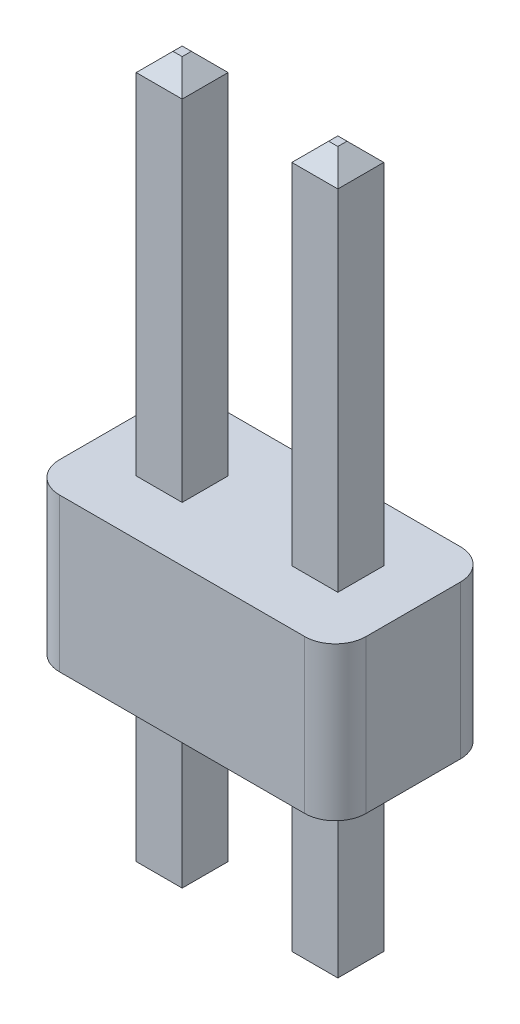
ISO-10303-21;
HEADER;
FILE_DESCRIPTION(('STEP AP214'),'2;1');
FILE_NAME('part.step','',(''),(''),'','','');
FILE_SCHEMA(('AUTOMOTIVE_DESIGN { 1 0 10303 214 1 1 1 1 }'));
ENDSEC;
DATA;
#1=APPLICATION_CONTEXT('core data for automotive mechanical design processes');
#2=APPLICATION_PROTOCOL_DEFINITION('international standard','automotive_design',2000,#1);
#3=PRODUCT_CONTEXT('',#1,'mechanical');
#4=PRODUCT('Part','Part','',(#3));
#5=PRODUCT_RELATED_PRODUCT_CATEGORY('part','',(#4));
#6=PRODUCT_DEFINITION_FORMATION('','',#4);
#7=PRODUCT_DEFINITION_CONTEXT('part definition',#1,'design');
#8=PRODUCT_DEFINITION('design','',#6,#7);
#9=PRODUCT_DEFINITION_SHAPE('','',#8);
#10=(LENGTH_UNIT() NAMED_UNIT(*) SI_UNIT(.MILLI.,.METRE.));
#11=(NAMED_UNIT(*) PLANE_ANGLE_UNIT() SI_UNIT($,.RADIAN.));
#12=(NAMED_UNIT(*) SI_UNIT($,.STERADIAN.) SOLID_ANGLE_UNIT());
#13=UNCERTAINTY_MEASURE_WITH_UNIT(LENGTH_MEASURE(1.E-05),#10,'distance_accuracy_value','');
#14=(GEOMETRIC_REPRESENTATION_CONTEXT(3) GLOBAL_UNCERTAINTY_ASSIGNED_CONTEXT((#13)) GLOBAL_UNIT_ASSIGNED_CONTEXT((#10,
#11,#12)) REPRESENTATION_CONTEXT('',''));
#15=CARTESIAN_POINT('',(0.,0.,0.));
#16=DIRECTION('',(0.,0.,1.));
#17=DIRECTION('',(1.,0.,0.));
#18=AXIS2_PLACEMENT_3D('',#15,#16,#17);
#19=CARTESIAN_POINT('',(2.,2.5,0.77));
#20=DIRECTION('',(0.,-1.,0.));
#21=DIRECTION('',(0.,0.,-1.));
#22=AXIS2_PLACEMENT_3D('',#19,#20,#21);
#23=CYLINDRICAL_SURFACE('',#22,0.5);
#24=CARTESIAN_POINT('',(2.,0.,0.77));
#25=DIRECTION('',(0.,1.,0.));
#26=DIRECTION('',(0.,0.,1.));
#27=AXIS2_PLACEMENT_3D('',#24,#25,#26);
#28=CIRCLE('',#27,0.5);
#29=CARTESIAN_POINT('',(2.,0.,1.27));
#30=VERTEX_POINT('',#29);
#31=CARTESIAN_POINT('',(2.5,0.,0.77));
#32=VERTEX_POINT('',#31);
#33=EDGE_CURVE('E283',#30,#32,#28,.T.);
#34=ORIENTED_EDGE('',*,*,#33,.T.);
#35=DIRECTION('',(0.,-1.,0.));
#36=VECTOR('',#35,1.);
#37=CARTESIAN_POINT('',(2.5,2.5,0.77));
#38=LINE('',#37,#36);
#39=CARTESIAN_POINT('',(2.5,2.5,0.77));
#40=VERTEX_POINT('',#39);
#41=EDGE_CURVE('E338',#40,#32,#38,.T.);
#42=ORIENTED_EDGE('',*,*,#41,.F.);
#43=CARTESIAN_POINT('',(2.,2.5,0.77));
#44=DIRECTION('',(0.,1.,0.));
#45=DIRECTION('',(0.,0.,1.));
#46=AXIS2_PLACEMENT_3D('',#43,#44,#45);
#47=CIRCLE('',#46,0.5);
#48=CARTESIAN_POINT('',(2.,2.5,1.27));
#49=VERTEX_POINT('',#48);
#50=EDGE_CURVE('E284',#49,#40,#47,.T.);
#51=ORIENTED_EDGE('',*,*,#50,.F.);
#52=DIRECTION('',(0.,-1.,0.));
#53=VECTOR('',#52,1.);
#54=CARTESIAN_POINT('',(2.,2.5,1.27));
#55=LINE('',#54,#53);
#56=EDGE_CURVE('E302',#49,#30,#55,.T.);
#57=ORIENTED_EDGE('',*,*,#56,.T.);
#58=EDGE_LOOP('',(#34,#42,#51,#57));
#59=FACE_BOUND('',#58,.T.);
#60=ADVANCED_FACE('F17',(#59),#23,.T.);
#61=CARTESIAN_POINT('',(2.5,2.5,-0.77));
#62=DIRECTION('',(-1.,0.,0.));
#63=DIRECTION('',(0.,0.,1.));
#64=AXIS2_PLACEMENT_3D('',#61,#62,#63);
#65=PLANE('',#64);
#66=DIRECTION('',(0.,0.,-1.));
#67=VECTOR('',#66,1.);
#68=CARTESIAN_POINT('',(2.5,0.,-0.77));
#69=LINE('',#68,#67);
#70=CARTESIAN_POINT('',(2.5,0.,-0.77));
#71=VERTEX_POINT('',#70);
#72=EDGE_CURVE('E305',#32,#71,#69,.T.);
#73=ORIENTED_EDGE('',*,*,#72,.T.);
#74=DIRECTION('',(0.,-1.,0.));
#75=VECTOR('',#74,1.);
#76=CARTESIAN_POINT('',(2.5,2.5,-0.77));
#77=LINE('',#76,#75);
#78=CARTESIAN_POINT('',(2.5,2.5,-0.77));
#79=VERTEX_POINT('',#78);
#80=EDGE_CURVE('E335',#79,#71,#77,.T.);
#81=ORIENTED_EDGE('',*,*,#80,.F.);
#82=DIRECTION('',(0.,0.,-1.));
#83=VECTOR('',#82,1.);
#84=CARTESIAN_POINT('',(2.5,2.5,-0.77));
#85=LINE('',#84,#83);
#86=EDGE_CURVE('E287',#40,#79,#85,.T.);
#87=ORIENTED_EDGE('',*,*,#86,.F.);
#88=ORIENTED_EDGE('',*,*,#41,.T.);
#89=EDGE_LOOP('',(#73,#81,#87,#88));
#90=FACE_BOUND('',#89,.T.);
#91=ADVANCED_FACE('F505',(#90),#65,.F.);
#92=CARTESIAN_POINT('',(2.,2.5,-0.77));
#93=DIRECTION('',(0.,-1.,0.));
#94=DIRECTION('',(0.,0.,-1.));
#95=AXIS2_PLACEMENT_3D('',#92,#93,#94);
#96=CYLINDRICAL_SURFACE('',#95,0.5);
#97=CARTESIAN_POINT('',(2.,0.,-0.77));
#98=DIRECTION('',(0.,1.,0.));
#99=DIRECTION('',(0.,0.,1.));
#100=AXIS2_PLACEMENT_3D('',#97,#98,#99);
#101=CIRCLE('',#100,0.5);
#102=CARTESIAN_POINT('',(2.,0.,-1.27));
#103=VERTEX_POINT('',#102);
#104=EDGE_CURVE('E307',#71,#103,#101,.T.);
#105=ORIENTED_EDGE('',*,*,#104,.T.);
#106=DIRECTION('',(0.,-1.,0.));
#107=VECTOR('',#106,1.);
#108=CARTESIAN_POINT('',(2.,2.5,-1.27));
#109=LINE('',#108,#107);
#110=CARTESIAN_POINT('',(2.,2.5,-1.27));
#111=VERTEX_POINT('',#110);
#112=EDGE_CURVE('E332',#111,#103,#109,.T.);
#113=ORIENTED_EDGE('',*,*,#112,.F.);
#114=CARTESIAN_POINT('',(2.,2.5,-0.77));
#115=DIRECTION('',(0.,1.,0.));
#116=DIRECTION('',(0.,0.,1.));
#117=AXIS2_PLACEMENT_3D('',#114,#115,#116);
#118=CIRCLE('',#117,0.5);
#119=EDGE_CURVE('E290',#79,#111,#118,.T.);
#120=ORIENTED_EDGE('',*,*,#119,.F.);
#121=ORIENTED_EDGE('',*,*,#80,.T.);
#122=EDGE_LOOP('',(#105,#113,#120,#121));
#123=FACE_BOUND('',#122,.T.);
#124=ADVANCED_FACE('F511',(#123),#96,.T.);
#125=CARTESIAN_POINT('',(-2.,2.5,-1.27));
#126=DIRECTION('',(0.,0.,1.));
#127=DIRECTION('',(1.,0.,0.));
#128=AXIS2_PLACEMENT_3D('',#125,#126,#127);
#129=PLANE('',#128);
#130=DIRECTION('',(-1.,0.,0.));
#131=VECTOR('',#130,1.);
#132=CARTESIAN_POINT('',(-2.,0.,-1.27));
#133=LINE('',#132,#131);
#134=CARTESIAN_POINT('',(-2.,0.,-1.27));
#135=VERTEX_POINT('',#134);
#136=EDGE_CURVE('E309',#103,#135,#133,.T.);
#137=ORIENTED_EDGE('',*,*,#136,.T.);
#138=DIRECTION('',(0.,-1.,0.));
#139=VECTOR('',#138,1.);
#140=CARTESIAN_POINT('',(-2.,2.5,-1.27));
#141=LINE('',#140,#139);
#142=CARTESIAN_POINT('',(-2.,2.5,-1.27));
#143=VERTEX_POINT('',#142);
#144=EDGE_CURVE('E329',#143,#135,#141,.T.);
#145=ORIENTED_EDGE('',*,*,#144,.F.);
#146=DIRECTION('',(-1.,0.,0.));
#147=VECTOR('',#146,1.);
#148=CARTESIAN_POINT('',(-2.,2.5,-1.27));
#149=LINE('',#148,#147);
#150=EDGE_CURVE('E292',#111,#143,#149,.T.);
#151=ORIENTED_EDGE('',*,*,#150,.F.);
#152=ORIENTED_EDGE('',*,*,#112,.T.);
#153=EDGE_LOOP('',(#137,#145,#151,#152));
#154=FACE_BOUND('',#153,.T.);
#155=ADVANCED_FACE('F875',(#154),#129,.F.);
#156=CARTESIAN_POINT('',(-2.,2.5,-0.77));
#157=DIRECTION('',(0.,-1.,0.));
#158=DIRECTION('',(0.,0.,-1.));
#159=AXIS2_PLACEMENT_3D('',#156,#157,#158);
#160=CYLINDRICAL_SURFACE('',#159,0.5);
#161=CARTESIAN_POINT('',(-2.,0.,-0.77));
#162=DIRECTION('',(0.,1.,0.));
#163=DIRECTION('',(0.,0.,1.));
#164=AXIS2_PLACEMENT_3D('',#161,#162,#163);
#165=CIRCLE('',#164,0.5);
#166=CARTESIAN_POINT('',(-2.5,0.,-0.77));
#167=VERTEX_POINT('',#166);
#168=EDGE_CURVE('E311',#135,#167,#165,.T.);
#169=ORIENTED_EDGE('',*,*,#168,.T.);
#170=DIRECTION('',(0.,-1.,0.));
#171=VECTOR('',#170,1.);
#172=CARTESIAN_POINT('',(-2.5,2.5,-0.77));
#173=LINE('',#172,#171);
#174=CARTESIAN_POINT('',(-2.5,2.5,-0.77));
#175=VERTEX_POINT('',#174);
#176=EDGE_CURVE('E326',#175,#167,#173,.T.);
#177=ORIENTED_EDGE('',*,*,#176,.F.);
#178=CARTESIAN_POINT('',(-2.,2.5,-0.77));
#179=DIRECTION('',(0.,1.,0.));
#180=DIRECTION('',(0.,0.,1.));
#181=AXIS2_PLACEMENT_3D('',#178,#179,#180);
#182=CIRCLE('',#181,0.5);
#183=EDGE_CURVE('E294',#143,#175,#182,.T.);
#184=ORIENTED_EDGE('',*,*,#183,.F.);
#185=ORIENTED_EDGE('',*,*,#144,.T.);
#186=EDGE_LOOP('',(#169,#177,#184,#185));
#187=FACE_BOUND('',#186,.T.);
#188=ADVANCED_FACE('F864',(#187),#160,.T.);
#189=CARTESIAN_POINT('',(-2.5,2.5,0.77));
#190=DIRECTION('',(1.,0.,0.));
#191=DIRECTION('',(0.,0.,-1.));
#192=AXIS2_PLACEMENT_3D('',#189,#190,#191);
#193=PLANE('',#192);
#194=DIRECTION('',(0.,0.,1.));
#195=VECTOR('',#194,1.);
#196=CARTESIAN_POINT('',(-2.5,0.,0.77));
#197=LINE('',#196,#195);
#198=CARTESIAN_POINT('',(-2.5,0.,0.77));
#199=VERTEX_POINT('',#198);
#200=EDGE_CURVE('E313',#167,#199,#197,.T.);
#201=ORIENTED_EDGE('',*,*,#200,.T.);
#202=DIRECTION('',(0.,-1.,0.));
#203=VECTOR('',#202,1.);
#204=CARTESIAN_POINT('',(-2.5,2.5,0.77));
#205=LINE('',#204,#203);
#206=CARTESIAN_POINT('',(-2.5,2.5,0.77));
#207=VERTEX_POINT('',#206);
#208=EDGE_CURVE('E323',#207,#199,#205,.T.);
#209=ORIENTED_EDGE('',*,*,#208,.F.);
#210=DIRECTION('',(0.,0.,1.));
#211=VECTOR('',#210,1.);
#212=CARTESIAN_POINT('',(-2.5,2.5,0.77));
#213=LINE('',#212,#211);
#214=EDGE_CURVE('E296',#175,#207,#213,.T.);
#215=ORIENTED_EDGE('',*,*,#214,.F.);
#216=ORIENTED_EDGE('',*,*,#176,.T.);
#217=EDGE_LOOP('',(#201,#209,#215,#216));
#218=FACE_BOUND('',#217,.T.);
#219=ADVANCED_FACE('F853',(#218),#193,.F.);
#220=CARTESIAN_POINT('',(-2.,2.5,0.77));
#221=DIRECTION('',(0.,-1.,0.));
#222=DIRECTION('',(0.,0.,-1.));
#223=AXIS2_PLACEMENT_3D('',#220,#221,#222);
#224=CYLINDRICAL_SURFACE('',#223,0.5);
#225=CARTESIAN_POINT('',(-2.,0.,0.77));
#226=DIRECTION('',(0.,1.,0.));
#227=DIRECTION('',(0.,0.,1.));
#228=AXIS2_PLACEMENT_3D('',#225,#226,#227);
#229=CIRCLE('',#228,0.5);
#230=CARTESIAN_POINT('',(-2.,0.,1.27));
#231=VERTEX_POINT('',#230);
#232=EDGE_CURVE('E315',#199,#231,#229,.T.);
#233=ORIENTED_EDGE('',*,*,#232,.T.);
#234=DIRECTION('',(0.,-1.,0.));
#235=VECTOR('',#234,1.);
#236=CARTESIAN_POINT('',(-2.,2.5,1.27));
#237=LINE('',#236,#235);
#238=CARTESIAN_POINT('',(-2.,2.5,1.27));
#239=VERTEX_POINT('',#238);
#240=EDGE_CURVE('E320',#239,#231,#237,.T.);
#241=ORIENTED_EDGE('',*,*,#240,.F.);
#242=CARTESIAN_POINT('',(-2.,2.5,0.77));
#243=DIRECTION('',(0.,1.,0.));
#244=DIRECTION('',(0.,0.,1.));
#245=AXIS2_PLACEMENT_3D('',#242,#243,#244);
#246=CIRCLE('',#245,0.5);
#247=EDGE_CURVE('E298',#207,#239,#246,.T.);
#248=ORIENTED_EDGE('',*,*,#247,.F.);
#249=ORIENTED_EDGE('',*,*,#208,.T.);
#250=EDGE_LOOP('',(#233,#241,#248,#249));
#251=FACE_BOUND('',#250,.T.);
#252=ADVANCED_FACE('F842',(#251),#224,.T.);
#253=CARTESIAN_POINT('',(2.,2.5,1.27));
#254=DIRECTION('',(0.,0.,-1.));
#255=DIRECTION('',(-1.,0.,0.));
#256=AXIS2_PLACEMENT_3D('',#253,#254,#255);
#257=PLANE('',#256);
#258=DIRECTION('',(1.,0.,0.));
#259=VECTOR('',#258,1.);
#260=CARTESIAN_POINT('',(2.,0.,1.27));
#261=LINE('',#260,#259);
#262=EDGE_CURVE('E288',#231,#30,#261,.T.);
#263=ORIENTED_EDGE('',*,*,#262,.T.);
#264=ORIENTED_EDGE('',*,*,#56,.F.);
#265=DIRECTION('',(1.,0.,0.));
#266=VECTOR('',#265,1.);
#267=CARTESIAN_POINT('',(2.,2.5,1.27));
#268=LINE('',#267,#266);
#269=EDGE_CURVE('E300',#239,#49,#268,.T.);
#270=ORIENTED_EDGE('',*,*,#269,.F.);
#271=ORIENTED_EDGE('',*,*,#240,.T.);
#272=EDGE_LOOP('',(#263,#264,#270,#271));
#273=FACE_BOUND('',#272,.T.);
#274=ADVANCED_FACE('F832',(#273),#257,.F.);
#275=CARTESIAN_POINT('',(2.,2.5,0.77));
#276=DIRECTION('',(0.,1.,0.));
#277=DIRECTION('',(0.,0.,1.));
#278=AXIS2_PLACEMENT_3D('',#275,#276,#277);
#279=PLANE('',#278);
#280=DIRECTION('',(0.,0.,1.));
#281=VECTOR('',#280,1.);
#282=CARTESIAN_POINT('',(0.895,2.5,0.77));
#283=LINE('',#282,#281);
#284=CARTESIAN_POINT('',(0.895,2.5,-0.375));
#285=VERTEX_POINT('',#284);
#286=CARTESIAN_POINT('',(0.895,2.5,0.375));
#287=VERTEX_POINT('',#286);
#288=EDGE_CURVE('E257',#285,#287,#283,.T.);
#289=ORIENTED_EDGE('',*,*,#288,.F.);
#290=DIRECTION('',(-1.,0.,0.));
#291=VECTOR('',#290,1.);
#292=CARTESIAN_POINT('',(2.,2.5,-0.375));
#293=LINE('',#292,#291);
#294=CARTESIAN_POINT('',(1.645,2.5,-0.375));
#295=VERTEX_POINT('',#294);
#296=EDGE_CURVE('E235',#295,#285,#293,.T.);
#297=ORIENTED_EDGE('',*,*,#296,.F.);
#298=DIRECTION('',(0.,0.,-1.));
#299=VECTOR('',#298,1.);
#300=CARTESIAN_POINT('',(1.645,2.5,0.77));
#301=LINE('',#300,#299);
#302=CARTESIAN_POINT('',(1.645,2.5,0.375));
#303=VERTEX_POINT('',#302);
#304=EDGE_CURVE('E228',#303,#295,#301,.T.);
#305=ORIENTED_EDGE('',*,*,#304,.F.);
#306=DIRECTION('',(1.,0.,0.));
#307=VECTOR('',#306,1.);
#308=CARTESIAN_POINT('',(2.,2.5,0.375));
#309=LINE('',#308,#307);
#310=EDGE_CURVE('E232',#287,#303,#309,.T.);
#311=ORIENTED_EDGE('',*,*,#310,.F.);
#312=EDGE_LOOP('',(#289,#297,#305,#311));
#313=FACE_BOUND('',#312,.T.);
#314=DIRECTION('',(0.,0.,-1.));
#315=VECTOR('',#314,1.);
#316=CARTESIAN_POINT('',(-0.895,2.5,0.77));
#317=LINE('',#316,#315);
#318=CARTESIAN_POINT('',(-0.895,2.5,0.375));
#319=VERTEX_POINT('',#318);
#320=CARTESIAN_POINT('',(-0.895,2.5,-0.375));
#321=VERTEX_POINT('',#320);
#322=EDGE_CURVE('E280',#319,#321,#317,.T.);
#323=ORIENTED_EDGE('',*,*,#322,.F.);
#324=DIRECTION('',(1.,0.,0.));
#325=VECTOR('',#324,1.);
#326=CARTESIAN_POINT('',(2.,2.5,0.375));
#327=LINE('',#326,#325);
#328=CARTESIAN_POINT('',(-1.645,2.5,0.375));
#329=VERTEX_POINT('',#328);
#330=EDGE_CURVE('E277',#329,#319,#327,.T.);
#331=ORIENTED_EDGE('',*,*,#330,.F.);
#332=DIRECTION('',(0.,0.,1.));
#333=VECTOR('',#332,1.);
#334=CARTESIAN_POINT('',(-1.645,2.5,0.77));
#335=LINE('',#334,#333);
#336=CARTESIAN_POINT('',(-1.645,2.5,-0.375));
#337=VERTEX_POINT('',#336);
#338=EDGE_CURVE('E274',#337,#329,#335,.T.);
#339=ORIENTED_EDGE('',*,*,#338,.F.);
#340=DIRECTION('',(-1.,0.,0.));
#341=VECTOR('',#340,1.);
#342=CARTESIAN_POINT('',(2.,2.5,-0.375));
#343=LINE('',#342,#341);
#344=EDGE_CURVE('E262',#321,#337,#343,.T.);
#345=ORIENTED_EDGE('',*,*,#344,.F.);
#346=EDGE_LOOP('',(#323,#331,#339,#345));
#347=FACE_BOUND('',#346,.T.);
#348=ORIENTED_EDGE('',*,*,#50,.T.);
#349=ORIENTED_EDGE('',*,*,#86,.T.);
#350=ORIENTED_EDGE('',*,*,#119,.T.);
#351=ORIENTED_EDGE('',*,*,#150,.T.);
#352=ORIENTED_EDGE('',*,*,#183,.T.);
#353=ORIENTED_EDGE('',*,*,#214,.T.);
#354=ORIENTED_EDGE('',*,*,#247,.T.);
#355=ORIENTED_EDGE('',*,*,#269,.T.);
#356=EDGE_LOOP('',(#348,#349,#350,#351,#352,#353,#354,#355));
#357=FACE_BOUND('',#356,.T.);
#358=ADVANCED_FACE('F230',(#313,#347,#357),#279,.T.);
#359=CARTESIAN_POINT('',(2.,0.,0.77));
#360=DIRECTION('',(0.,1.,0.));
#361=DIRECTION('',(0.,0.,1.));
#362=AXIS2_PLACEMENT_3D('',#359,#360,#361);
#363=PLANE('',#362);
#364=DIRECTION('',(-1.,0.,0.));
#365=VECTOR('',#364,1.);
#366=CARTESIAN_POINT('',(2.,0.,-0.375));
#367=LINE('',#366,#365);
#368=CARTESIAN_POINT('',(1.645,0.,-0.375));
#369=VERTEX_POINT('',#368);
#370=CARTESIAN_POINT('',(0.895,0.,-0.375));
#371=VERTEX_POINT('',#370);
#372=EDGE_CURVE('E359',#369,#371,#367,.T.);
#373=ORIENTED_EDGE('',*,*,#372,.T.);
#374=DIRECTION('',(0.,0.,1.));
#375=VECTOR('',#374,1.);
#376=CARTESIAN_POINT('',(0.895,0.,0.77));
#377=LINE('',#376,#375);
#378=CARTESIAN_POINT('',(0.895,0.,0.375));
#379=VERTEX_POINT('',#378);
#380=EDGE_CURVE('E362',#371,#379,#377,.T.);
#381=ORIENTED_EDGE('',*,*,#380,.T.);
#382=DIRECTION('',(1.,0.,0.));
#383=VECTOR('',#382,1.);
#384=CARTESIAN_POINT('',(2.,0.,0.375));
#385=LINE('',#384,#383);
#386=CARTESIAN_POINT('',(1.645,0.,0.375));
#387=VERTEX_POINT('',#386);
#388=EDGE_CURVE('E353',#379,#387,#385,.T.);
#389=ORIENTED_EDGE('',*,*,#388,.T.);
#390=DIRECTION('',(0.,0.,-1.));
#391=VECTOR('',#390,1.);
#392=CARTESIAN_POINT('',(1.645,0.,0.77));
#393=LINE('',#392,#391);
#394=EDGE_CURVE('E356',#387,#369,#393,.T.);
#395=ORIENTED_EDGE('',*,*,#394,.T.);
#396=EDGE_LOOP('',(#373,#381,#389,#395));
#397=FACE_BOUND('',#396,.T.);
#398=DIRECTION('',(1.,0.,0.));
#399=VECTOR('',#398,1.);
#400=CARTESIAN_POINT('',(2.,0.,0.375));
#401=LINE('',#400,#399);
#402=CARTESIAN_POINT('',(-1.645,0.,0.375));
#403=VERTEX_POINT('',#402);
#404=CARTESIAN_POINT('',(-0.895,0.,0.375));
#405=VERTEX_POINT('',#404);
#406=EDGE_CURVE('E347',#403,#405,#401,.T.);
#407=ORIENTED_EDGE('',*,*,#406,.T.);
#408=DIRECTION('',(0.,0.,-1.));
#409=VECTOR('',#408,1.);
#410=CARTESIAN_POINT('',(-0.895,0.,0.77));
#411=LINE('',#410,#409);
#412=CARTESIAN_POINT('',(-0.895,0.,-0.375));
#413=VERTEX_POINT('',#412);
#414=EDGE_CURVE('E350',#405,#413,#411,.T.);
#415=ORIENTED_EDGE('',*,*,#414,.T.);
#416=DIRECTION('',(-1.,0.,0.));
#417=VECTOR('',#416,1.);
#418=CARTESIAN_POINT('',(2.,0.,-0.375));
#419=LINE('',#418,#417);
#420=CARTESIAN_POINT('',(-1.645,0.,-0.375));
#421=VERTEX_POINT('',#420);
#422=EDGE_CURVE('E341',#413,#421,#419,.T.);
#423=ORIENTED_EDGE('',*,*,#422,.T.);
#424=DIRECTION('',(0.,0.,1.));
#425=VECTOR('',#424,1.);
#426=CARTESIAN_POINT('',(-1.645,0.,0.77));
#427=LINE('',#426,#425);
#428=EDGE_CURVE('E344',#421,#403,#427,.T.);
#429=ORIENTED_EDGE('',*,*,#428,.T.);
#430=EDGE_LOOP('',(#407,#415,#423,#429));
#431=FACE_BOUND('',#430,.T.);
#432=ORIENTED_EDGE('',*,*,#33,.F.);
#433=ORIENTED_EDGE('',*,*,#262,.F.);
#434=ORIENTED_EDGE('',*,*,#232,.F.);
#435=ORIENTED_EDGE('',*,*,#200,.F.);
#436=ORIENTED_EDGE('',*,*,#168,.F.);
#437=ORIENTED_EDGE('',*,*,#136,.F.);
#438=ORIENTED_EDGE('',*,*,#104,.F.);
#439=ORIENTED_EDGE('',*,*,#72,.F.);
#440=EDGE_LOOP('',(#432,#433,#434,#435,#436,#437,#438,#439));
#441=FACE_BOUND('',#440,.T.);
#442=ADVANCED_FACE('F810',(#397,#431,#441),#363,.F.);
#443=CARTESIAN_POINT('',(0.,-3.25,0.));
#444=DIRECTION('',(0.,-1.,0.));
#445=DIRECTION('',(0.,0.,-1.));
#446=AXIS2_PLACEMENT_3D('',#443,#444,#445);
#447=PLANE('',#446);
#448=DIRECTION('',(0.,0.,1.));
#449=VECTOR('',#448,1.);
#450=CARTESIAN_POINT('',(-1.195,-3.25,0.));
#451=LINE('',#450,#449);
#452=CARTESIAN_POINT('',(-1.195,-3.25,-0.075));
#453=VERTEX_POINT('',#452);
#454=CARTESIAN_POINT('',(-1.195,-3.25,0.075));
#455=VERTEX_POINT('',#454);
#456=EDGE_CURVE('E388',#453,#455,#451,.T.);
#457=ORIENTED_EDGE('',*,*,#456,.T.);
#458=DIRECTION('',(-1.,0.,0.));
#459=VECTOR('',#458,1.);
#460=CARTESIAN_POINT('',(0.,-3.25,0.075));
#461=LINE('',#460,#459);
#462=CARTESIAN_POINT('',(-1.345,-3.25,0.075));
#463=VERTEX_POINT('',#462);
#464=EDGE_CURVE('E392',#455,#463,#461,.T.);
#465=ORIENTED_EDGE('',*,*,#464,.T.);
#466=DIRECTION('',(0.,0.,-1.));
#467=VECTOR('',#466,1.);
#468=CARTESIAN_POINT('',(-1.345,-3.25,0.));
#469=LINE('',#468,#467);
#470=CARTESIAN_POINT('',(-1.345,-3.25,-0.075));
#471=VERTEX_POINT('',#470);
#472=EDGE_CURVE('E390',#463,#471,#469,.T.);
#473=ORIENTED_EDGE('',*,*,#472,.T.);
#474=DIRECTION('',(1.,0.,0.));
#475=VECTOR('',#474,1.);
#476=CARTESIAN_POINT('',(0.,-3.25,-0.075));
#477=LINE('',#476,#475);
#478=EDGE_CURVE('E386',#471,#453,#477,.T.);
#479=ORIENTED_EDGE('',*,*,#478,.T.);
#480=EDGE_LOOP('',(#457,#465,#473,#479));
#481=FACE_BOUND('',#480,.T.);
#482=ADVANCED_FACE('F801',(#481),#447,.T.);
#483=CARTESIAN_POINT('',(-1.645,-3.25,-0.375));
#484=DIRECTION('',(0.,0.,-1.));
#485=DIRECTION('',(-1.,0.,0.));
#486=AXIS2_PLACEMENT_3D('',#483,#484,#485);
#487=PLANE('',#486);
#488=DIRECTION('',(0.,1.,0.));
#489=VECTOR('',#488,1.);
#490=CARTESIAN_POINT('',(-0.895,-3.25,-0.375));
#491=LINE('',#490,#489);
#492=CARTESIAN_POINT('',(-0.895,-2.95,-0.375));
#493=VERTEX_POINT('',#492);
#494=EDGE_CURVE('E270',#493,#413,#491,.T.);
#495=ORIENTED_EDGE('',*,*,#494,.F.);
#496=DIRECTION('',(-1.,0.,0.));
#497=VECTOR('',#496,1.);
#498=CARTESIAN_POINT('',(-1.645,-2.95,-0.375));
#499=LINE('',#498,#497);
#500=CARTESIAN_POINT('',(-1.645,-2.95,-0.375));
#501=VERTEX_POINT('',#500);
#502=EDGE_CURVE('E399',#493,#501,#499,.T.);
#503=ORIENTED_EDGE('',*,*,#502,.T.);
#504=DIRECTION('',(0.,1.,0.));
#505=VECTOR('',#504,1.);
#506=CARTESIAN_POINT('',(-1.645,-3.25,-0.375));
#507=LINE('',#506,#505);
#508=EDGE_CURVE('E267',#501,#421,#507,.T.);
#509=ORIENTED_EDGE('',*,*,#508,.T.);
#510=ORIENTED_EDGE('',*,*,#422,.F.);
#511=EDGE_LOOP('',(#495,#503,#509,#510));
#512=FACE_BOUND('',#511,.T.);
#513=ADVANCED_FACE('F737',(#512),#487,.T.);
#514=CARTESIAN_POINT('',(-1.645,-3.25,0.375));
#515=DIRECTION('',(-1.,0.,0.));
#516=DIRECTION('',(0.,0.,1.));
#517=AXIS2_PLACEMENT_3D('',#514,#515,#516);
#518=PLANE('',#517);
#519=ORIENTED_EDGE('',*,*,#508,.F.);
#520=DIRECTION('',(0.,0.,1.));
#521=VECTOR('',#520,1.);
#522=CARTESIAN_POINT('',(-1.645,-2.95,0.375));
#523=LINE('',#522,#521);
#524=CARTESIAN_POINT('',(-1.645,-2.95,0.375));
#525=VERTEX_POINT('',#524);
#526=EDGE_CURVE('E395',#501,#525,#523,.T.);
#527=ORIENTED_EDGE('',*,*,#526,.T.);
#528=DIRECTION('',(0.,1.,0.));
#529=VECTOR('',#528,1.);
#530=CARTESIAN_POINT('',(-1.645,-3.25,0.375));
#531=LINE('',#530,#529);
#532=EDGE_CURVE('E264',#525,#403,#531,.T.);
#533=ORIENTED_EDGE('',*,*,#532,.T.);
#534=ORIENTED_EDGE('',*,*,#428,.F.);
#535=EDGE_LOOP('',(#519,#527,#533,#534));
#536=FACE_BOUND('',#535,.T.);
#537=ADVANCED_FACE('F748',(#536),#518,.T.);
#538=CARTESIAN_POINT('',(-0.895,-3.25,0.375));
#539=DIRECTION('',(0.,0.,1.));
#540=DIRECTION('',(1.,0.,0.));
#541=AXIS2_PLACEMENT_3D('',#538,#539,#540);
#542=PLANE('',#541);
#543=ORIENTED_EDGE('',*,*,#532,.F.);
#544=DIRECTION('',(1.,0.,0.));
#545=VECTOR('',#544,1.);
#546=CARTESIAN_POINT('',(-0.895,-2.95,0.375));
#547=LINE('',#546,#545);
#548=CARTESIAN_POINT('',(-0.895,-2.95,0.375));
#549=VERTEX_POINT('',#548);
#550=EDGE_CURVE('E383',#525,#549,#547,.T.);
#551=ORIENTED_EDGE('',*,*,#550,.T.);
#552=DIRECTION('',(0.,1.,0.));
#553=VECTOR('',#552,1.);
#554=CARTESIAN_POINT('',(-0.895,-3.25,0.375));
#555=LINE('',#554,#553);
#556=EDGE_CURVE('E260',#549,#405,#555,.T.);
#557=ORIENTED_EDGE('',*,*,#556,.T.);
#558=ORIENTED_EDGE('',*,*,#406,.F.);
#559=EDGE_LOOP('',(#543,#551,#557,#558));
#560=FACE_BOUND('',#559,.T.);
#561=ADVANCED_FACE('F759',(#560),#542,.T.);
#562=CARTESIAN_POINT('',(-0.895,-3.25,-0.375));
#563=DIRECTION('',(1.,0.,0.));
#564=DIRECTION('',(0.,0.,-1.));
#565=AXIS2_PLACEMENT_3D('',#562,#563,#564);
#566=PLANE('',#565);
#567=ORIENTED_EDGE('',*,*,#556,.F.);
#568=DIRECTION('',(0.,0.,-1.));
#569=VECTOR('',#568,1.);
#570=CARTESIAN_POINT('',(-0.895,-2.95,-0.375));
#571=LINE('',#570,#569);
#572=EDGE_CURVE('E397',#549,#493,#571,.T.);
#573=ORIENTED_EDGE('',*,*,#572,.T.);
#574=ORIENTED_EDGE('',*,*,#494,.T.);
#575=ORIENTED_EDGE('',*,*,#414,.F.);
#576=EDGE_LOOP('',(#567,#573,#574,#575));
#577=FACE_BOUND('',#576,.T.);
#578=ADVANCED_FACE('F767',(#577),#566,.T.);
#579=CARTESIAN_POINT('',(-0.895,8.2,-0.375));
#580=VERTEX_POINT('',#579);
#581=EDGE_CURVE('E259',#321,#580,#491,.T.);
#582=ORIENTED_EDGE('',*,*,#581,.T.);
#583=DIRECTION('',(0.,0.,1.));
#584=VECTOR('',#583,1.);
#585=CARTESIAN_POINT('',(-0.895,8.2,0.375));
#586=LINE('',#585,#584);
#587=CARTESIAN_POINT('',(-0.895,8.2,0.375));
#588=VERTEX_POINT('',#587);
#589=EDGE_CURVE('E415',#580,#588,#586,.T.);
#590=ORIENTED_EDGE('',*,*,#589,.T.);
#591=EDGE_CURVE('E263',#319,#588,#555,.T.);
#592=ORIENTED_EDGE('',*,*,#591,.F.);
#593=ORIENTED_EDGE('',*,*,#322,.T.);
#594=EDGE_LOOP('',(#582,#590,#592,#593));
#595=FACE_BOUND('',#594,.T.);
#596=ADVANCED_FACE('F756',(#595),#566,.T.);
#597=ORIENTED_EDGE('',*,*,#591,.T.);
#598=DIRECTION('',(-1.,0.,0.));
#599=VECTOR('',#598,1.);
#600=CARTESIAN_POINT('',(-1.645,8.2,0.375));
#601=LINE('',#600,#599);
#602=CARTESIAN_POINT('',(-1.645,8.2,0.375));
#603=VERTEX_POINT('',#602);
#604=EDGE_CURVE('E417',#588,#603,#601,.T.);
#605=ORIENTED_EDGE('',*,*,#604,.T.);
#606=EDGE_CURVE('E266',#329,#603,#531,.T.);
#607=ORIENTED_EDGE('',*,*,#606,.F.);
#608=ORIENTED_EDGE('',*,*,#330,.T.);
#609=EDGE_LOOP('',(#597,#605,#607,#608));
#610=FACE_BOUND('',#609,.T.);
#611=ADVANCED_FACE('F745',(#610),#542,.T.);
#612=ORIENTED_EDGE('',*,*,#606,.T.);
#613=DIRECTION('',(0.,0.,-1.));
#614=VECTOR('',#613,1.);
#615=CARTESIAN_POINT('',(-1.645,8.2,-0.375));
#616=LINE('',#615,#614);
#617=CARTESIAN_POINT('',(-1.645,8.2,-0.375));
#618=VERTEX_POINT('',#617);
#619=EDGE_CURVE('E410',#603,#618,#616,.T.);
#620=ORIENTED_EDGE('',*,*,#619,.T.);
#621=EDGE_CURVE('E269',#337,#618,#507,.T.);
#622=ORIENTED_EDGE('',*,*,#621,.F.);
#623=ORIENTED_EDGE('',*,*,#338,.T.);
#624=EDGE_LOOP('',(#612,#620,#622,#623));
#625=FACE_BOUND('',#624,.T.);
#626=ADVANCED_FACE('F734',(#625),#518,.T.);
#627=ORIENTED_EDGE('',*,*,#621,.T.);
#628=DIRECTION('',(1.,0.,0.));
#629=VECTOR('',#628,1.);
#630=CARTESIAN_POINT('',(-0.895,8.2,-0.375));
#631=LINE('',#630,#629);
#632=EDGE_CURVE('E413',#618,#580,#631,.T.);
#633=ORIENTED_EDGE('',*,*,#632,.T.);
#634=ORIENTED_EDGE('',*,*,#581,.F.);
#635=ORIENTED_EDGE('',*,*,#344,.T.);
#636=EDGE_LOOP('',(#627,#633,#634,#635));
#637=FACE_BOUND('',#636,.T.);
#638=ADVANCED_FACE('F724',(#637),#487,.T.);
#639=CARTESIAN_POINT('',(0.,8.5,0.));
#640=DIRECTION('',(0.,-1.,0.));
#641=DIRECTION('',(0.,0.,-1.));
#642=AXIS2_PLACEMENT_3D('',#639,#640,#641);
#643=PLANE('',#642);
#644=DIRECTION('',(-1.,0.,0.));
#645=VECTOR('',#644,1.);
#646=CARTESIAN_POINT('',(-1.645,8.5,-0.075));
#647=LINE('',#646,#645);
#648=CARTESIAN_POINT('',(-1.195,8.5,-0.075));
#649=VERTEX_POINT('',#648);
#650=CARTESIAN_POINT('',(-1.345,8.5,-0.075));
#651=VERTEX_POINT('',#650);
#652=EDGE_CURVE('E405',#649,#651,#647,.T.);
#653=ORIENTED_EDGE('',*,*,#652,.T.);
#654=DIRECTION('',(0.,0.,1.));
#655=VECTOR('',#654,1.);
#656=CARTESIAN_POINT('',(-1.345,8.5,0.375));
#657=LINE('',#656,#655);
#658=CARTESIAN_POINT('',(-1.345,8.5,0.075));
#659=VERTEX_POINT('',#658);
#660=EDGE_CURVE('E407',#651,#659,#657,.T.);
#661=ORIENTED_EDGE('',*,*,#660,.T.);
#662=DIRECTION('',(1.,0.,0.));
#663=VECTOR('',#662,1.);
#664=CARTESIAN_POINT('',(-0.895,8.5,0.075));
#665=LINE('',#664,#663);
#666=CARTESIAN_POINT('',(-1.195,8.5,0.075));
#667=VERTEX_POINT('',#666);
#668=EDGE_CURVE('E401',#659,#667,#665,.T.);
#669=ORIENTED_EDGE('',*,*,#668,.T.);
#670=DIRECTION('',(0.,0.,-1.));
#671=VECTOR('',#670,1.);
#672=CARTESIAN_POINT('',(-1.195,8.5,-0.375));
#673=LINE('',#672,#671);
#674=EDGE_CURVE('E403',#667,#649,#673,.T.);
#675=ORIENTED_EDGE('',*,*,#674,.T.);
#676=EDGE_LOOP('',(#653,#661,#669,#675));
#677=FACE_BOUND('',#676,.T.);
#678=ADVANCED_FACE('F715',(#677),#643,.F.);
#679=CARTESIAN_POINT('',(0.,-3.25,0.));
#680=DIRECTION('',(0.,-1.,0.));
#681=DIRECTION('',(0.,0.,-1.));
#682=AXIS2_PLACEMENT_3D('',#679,#680,#681);
#683=PLANE('',#682);
#684=DIRECTION('',(0.,0.,-1.));
#685=VECTOR('',#684,1.);
#686=CARTESIAN_POINT('',(1.195,-3.25,0.));
#687=LINE('',#686,#685);
#688=CARTESIAN_POINT('',(1.195,-3.25,0.075));
#689=VERTEX_POINT('',#688);
#690=CARTESIAN_POINT('',(1.195,-3.25,-0.075));
#691=VERTEX_POINT('',#690);
#692=EDGE_CURVE('E370',#689,#691,#687,.T.);
#693=ORIENTED_EDGE('',*,*,#692,.T.);
#694=DIRECTION('',(1.,0.,0.));
#695=VECTOR('',#694,1.);
#696=CARTESIAN_POINT('',(0.,-3.25,-0.075));
#697=LINE('',#696,#695);
#698=CARTESIAN_POINT('',(1.345,-3.25,-0.075));
#699=VERTEX_POINT('',#698);
#700=EDGE_CURVE('E374',#691,#699,#697,.T.);
#701=ORIENTED_EDGE('',*,*,#700,.T.);
#702=DIRECTION('',(0.,0.,1.));
#703=VECTOR('',#702,1.);
#704=CARTESIAN_POINT('',(1.345,-3.25,0.));
#705=LINE('',#704,#703);
#706=CARTESIAN_POINT('',(1.345,-3.25,0.075));
#707=VERTEX_POINT('',#706);
#708=EDGE_CURVE('E372',#699,#707,#705,.T.);
#709=ORIENTED_EDGE('',*,*,#708,.T.);
#710=DIRECTION('',(-1.,0.,0.));
#711=VECTOR('',#710,1.);
#712=CARTESIAN_POINT('',(0.,-3.25,0.075));
#713=LINE('',#712,#711);
#714=EDGE_CURVE('E368',#707,#689,#713,.T.);
#715=ORIENTED_EDGE('',*,*,#714,.T.);
#716=EDGE_LOOP('',(#693,#701,#709,#715));
#717=FACE_BOUND('',#716,.T.);
#718=ADVANCED_FACE('F706',(#717),#683,.T.);
#719=CARTESIAN_POINT('',(1.645,-3.25,0.375));
#720=DIRECTION('',(0.,0.,1.));
#721=DIRECTION('',(1.,0.,0.));
#722=AXIS2_PLACEMENT_3D('',#719,#720,#721);
#723=PLANE('',#722);
#724=DIRECTION('',(0.,1.,0.));
#725=VECTOR('',#724,1.);
#726=CARTESIAN_POINT('',(0.895,-3.25,0.375));
#727=LINE('',#726,#725);
#728=CARTESIAN_POINT('',(0.895,-2.95,0.375));
#729=VERTEX_POINT('',#728);
#730=EDGE_CURVE('E248',#729,#379,#727,.T.);
#731=ORIENTED_EDGE('',*,*,#730,.F.);
#732=DIRECTION('',(1.,0.,0.));
#733=VECTOR('',#732,1.);
#734=CARTESIAN_POINT('',(1.645,-2.95,0.375));
#735=LINE('',#734,#733);
#736=CARTESIAN_POINT('',(1.645,-2.95,0.375));
#737=VERTEX_POINT('',#736);
#738=EDGE_CURVE('E381',#729,#737,#735,.T.);
#739=ORIENTED_EDGE('',*,*,#738,.T.);
#740=DIRECTION('',(0.,1.,0.));
#741=VECTOR('',#740,1.);
#742=CARTESIAN_POINT('',(1.645,-3.25,0.375));
#743=LINE('',#742,#741);
#744=EDGE_CURVE('E247',#737,#387,#743,.T.);
#745=ORIENTED_EDGE('',*,*,#744,.T.);
#746=ORIENTED_EDGE('',*,*,#388,.F.);
#747=EDGE_LOOP('',(#731,#739,#745,#746));
#748=FACE_BOUND('',#747,.T.);
#749=ADVANCED_FACE('F502',(#748),#723,.T.);
#750=CARTESIAN_POINT('',(1.645,-3.25,-0.375));
#751=DIRECTION('',(1.,0.,0.));
#752=DIRECTION('',(0.,0.,-1.));
#753=AXIS2_PLACEMENT_3D('',#750,#751,#752);
#754=PLANE('',#753);
#755=ORIENTED_EDGE('',*,*,#744,.F.);
#756=DIRECTION('',(0.,0.,-1.));
#757=VECTOR('',#756,1.);
#758=CARTESIAN_POINT('',(1.645,-2.95,-0.375));
#759=LINE('',#758,#757);
#760=CARTESIAN_POINT('',(1.645,-2.95,-0.375));
#761=VERTEX_POINT('',#760);
#762=EDGE_CURVE('E377',#737,#761,#759,.T.);
#763=ORIENTED_EDGE('',*,*,#762,.T.);
#764=DIRECTION('',(0.,1.,0.));
#765=VECTOR('',#764,1.);
#766=CARTESIAN_POINT('',(1.645,-3.25,-0.375));
#767=LINE('',#766,#765);
#768=EDGE_CURVE('E253',#761,#369,#767,.T.);
#769=ORIENTED_EDGE('',*,*,#768,.T.);
#770=ORIENTED_EDGE('',*,*,#394,.F.);
#771=EDGE_LOOP('',(#755,#763,#769,#770));
#772=FACE_BOUND('',#771,.T.);
#773=ADVANCED_FACE('F656',(#772),#754,.T.);
#774=CARTESIAN_POINT('',(0.895,-3.25,-0.375));
#775=DIRECTION('',(0.,0.,-1.));
#776=DIRECTION('',(-1.,0.,0.));
#777=AXIS2_PLACEMENT_3D('',#774,#775,#776);
#778=PLANE('',#777);
#779=ORIENTED_EDGE('',*,*,#768,.F.);
#780=DIRECTION('',(-1.,0.,0.));
#781=VECTOR('',#780,1.);
#782=CARTESIAN_POINT('',(0.895,-2.95,-0.375));
#783=LINE('',#782,#781);
#784=CARTESIAN_POINT('',(0.895,-2.95,-0.375));
#785=VERTEX_POINT('',#784);
#786=EDGE_CURVE('E365',#761,#785,#783,.T.);
#787=ORIENTED_EDGE('',*,*,#786,.T.);
#788=DIRECTION('',(0.,1.,0.));
#789=VECTOR('',#788,1.);
#790=CARTESIAN_POINT('',(0.895,-3.25,-0.375));
#791=LINE('',#790,#789);
#792=EDGE_CURVE('E244',#785,#371,#791,.T.);
#793=ORIENTED_EDGE('',*,*,#792,.T.);
#794=ORIENTED_EDGE('',*,*,#372,.F.);
#795=EDGE_LOOP('',(#779,#787,#793,#794));
#796=FACE_BOUND('',#795,.T.);
#797=ADVANCED_FACE('F665',(#796),#778,.T.);
#798=CARTESIAN_POINT('',(0.895,-3.25,0.375));
#799=DIRECTION('',(-1.,0.,0.));
#800=DIRECTION('',(0.,0.,1.));
#801=AXIS2_PLACEMENT_3D('',#798,#799,#800);
#802=PLANE('',#801);
#803=ORIENTED_EDGE('',*,*,#792,.F.);
#804=DIRECTION('',(0.,0.,1.));
#805=VECTOR('',#804,1.);
#806=CARTESIAN_POINT('',(0.895,-2.95,0.375));
#807=LINE('',#806,#805);
#808=EDGE_CURVE('E379',#785,#729,#807,.T.);
#809=ORIENTED_EDGE('',*,*,#808,.T.);
#810=ORIENTED_EDGE('',*,*,#730,.T.);
#811=ORIENTED_EDGE('',*,*,#380,.F.);
#812=EDGE_LOOP('',(#803,#809,#810,#811));
#813=FACE_BOUND('',#812,.T.);
#814=ADVANCED_FACE('F673',(#813),#802,.T.);
#815=CARTESIAN_POINT('',(0.895,8.2,0.375));
#816=VERTEX_POINT('',#815);
#817=EDGE_CURVE('E243',#287,#816,#727,.T.);
#818=ORIENTED_EDGE('',*,*,#817,.T.);
#819=DIRECTION('',(0.,0.,-1.));
#820=VECTOR('',#819,1.);
#821=CARTESIAN_POINT('',(0.895,8.2,-0.375));
#822=LINE('',#821,#820);
#823=CARTESIAN_POINT('',(0.895,8.2,-0.375));
#824=VERTEX_POINT('',#823);
#825=EDGE_CURVE('E428',#816,#824,#822,.T.);
#826=ORIENTED_EDGE('',*,*,#825,.T.);
#827=EDGE_CURVE('E1027',#285,#824,#791,.T.);
#828=ORIENTED_EDGE('',*,*,#827,.F.);
#829=ORIENTED_EDGE('',*,*,#288,.T.);
#830=EDGE_LOOP('',(#818,#826,#828,#829));
#831=FACE_BOUND('',#830,.T.);
#832=ADVANCED_FACE('F483',(#831),#802,.T.);
#833=ORIENTED_EDGE('',*,*,#827,.T.);
#834=DIRECTION('',(1.,0.,0.));
#835=VECTOR('',#834,1.);
#836=CARTESIAN_POINT('',(1.645,8.2,-0.375));
#837=LINE('',#836,#835);
#838=CARTESIAN_POINT('',(1.645,8.2,-0.375));
#839=VERTEX_POINT('',#838);
#840=EDGE_CURVE('E41',#824,#839,#837,.T.);
#841=ORIENTED_EDGE('',*,*,#840,.T.);
#842=EDGE_CURVE('E250',#295,#839,#767,.T.);
#843=ORIENTED_EDGE('',*,*,#842,.F.);
#844=ORIENTED_EDGE('',*,*,#296,.T.);
#845=EDGE_LOOP('',(#833,#841,#843,#844));
#846=FACE_BOUND('',#845,.T.);
#847=ADVANCED_FACE('F654',(#846),#778,.T.);
#848=ORIENTED_EDGE('',*,*,#842,.T.);
#849=DIRECTION('',(0.,0.,1.));
#850=VECTOR('',#849,1.);
#851=CARTESIAN_POINT('',(1.645,8.2,0.375));
#852=LINE('',#851,#850);
#853=CARTESIAN_POINT('',(1.645,8.2,0.375));
#854=VERTEX_POINT('',#853);
#855=EDGE_CURVE('E26',#839,#854,#852,.T.);
#856=ORIENTED_EDGE('',*,*,#855,.T.);
#857=EDGE_CURVE('E240',#303,#854,#743,.T.);
#858=ORIENTED_EDGE('',*,*,#857,.F.);
#859=ORIENTED_EDGE('',*,*,#304,.T.);
#860=EDGE_LOOP('',(#848,#856,#858,#859));
#861=FACE_BOUND('',#860,.T.);
#862=ADVANCED_FACE('F246',(#861),#754,.T.);
#863=ORIENTED_EDGE('',*,*,#857,.T.);
#864=DIRECTION('',(-1.,0.,0.));
#865=VECTOR('',#864,1.);
#866=CARTESIAN_POINT('',(0.895,8.2,0.375));
#867=LINE('',#866,#865);
#868=EDGE_CURVE('E11',#854,#816,#867,.T.);
#869=ORIENTED_EDGE('',*,*,#868,.T.);
#870=ORIENTED_EDGE('',*,*,#817,.F.);
#871=ORIENTED_EDGE('',*,*,#310,.T.);
#872=EDGE_LOOP('',(#863,#869,#870,#871));
#873=FACE_BOUND('',#872,.T.);
#874=ADVANCED_FACE('F239',(#873),#723,.T.);
#875=CARTESIAN_POINT('',(0.,8.5,0.));
#876=DIRECTION('',(0.,-1.,0.));
#877=DIRECTION('',(0.,0.,-1.));
#878=AXIS2_PLACEMENT_3D('',#875,#876,#877);
#879=PLANE('',#878);
#880=DIRECTION('',(-1.,0.,0.));
#881=VECTOR('',#880,1.);
#882=CARTESIAN_POINT('',(0.895,8.5,-0.075));
#883=LINE('',#882,#881);
#884=CARTESIAN_POINT('',(1.345,8.5,-0.075));
#885=VERTEX_POINT('',#884);
#886=CARTESIAN_POINT('',(1.195,8.5,-0.075));
#887=VERTEX_POINT('',#886);
#888=EDGE_CURVE('E423',#885,#887,#883,.T.);
#889=ORIENTED_EDGE('',*,*,#888,.T.);
#890=DIRECTION('',(0.,0.,1.));
#891=VECTOR('',#890,1.);
#892=CARTESIAN_POINT('',(1.195,8.5,0.375));
#893=LINE('',#892,#891);
#894=CARTESIAN_POINT('',(1.195,8.5,0.075));
#895=VERTEX_POINT('',#894);
#896=EDGE_CURVE('E425',#887,#895,#893,.T.);
#897=ORIENTED_EDGE('',*,*,#896,.T.);
#898=DIRECTION('',(1.,0.,0.));
#899=VECTOR('',#898,1.);
#900=CARTESIAN_POINT('',(1.645,8.5,0.075));
#901=LINE('',#900,#899);
#902=CARTESIAN_POINT('',(1.345,8.5,0.075));
#903=VERTEX_POINT('',#902);
#904=EDGE_CURVE('E419',#895,#903,#901,.T.);
#905=ORIENTED_EDGE('',*,*,#904,.T.);
#906=DIRECTION('',(0.,0.,-1.));
#907=VECTOR('',#906,1.);
#908=CARTESIAN_POINT('',(1.345,8.5,-0.375));
#909=LINE('',#908,#907);
#910=EDGE_CURVE('E421',#903,#885,#909,.T.);
#911=ORIENTED_EDGE('',*,*,#910,.T.);
#912=EDGE_LOOP('',(#889,#897,#905,#911));
#913=FACE_BOUND('',#912,.T.);
#914=ADVANCED_FACE('F489',(#913),#879,.F.);
#915=CARTESIAN_POINT('',(1.645,-2.95,0.375));
#916=DIRECTION('',(0.,0.707106781186543,-0.707106781186552));
#917=DIRECTION('',(1.,0.,0.));
#918=AXIS2_PLACEMENT_3D('',#915,#916,#917);
#919=PLANE('',#918);
#920=DIRECTION('',(0.577350269189624,-0.57735026918963,-0.577350269189623));
#921=VECTOR('',#920,1.);
#922=CARTESIAN_POINT('',(1.145,-3.2,0.125000000000002));
#923=LINE('',#922,#921);
#924=EDGE_CURVE('E438',#689,#729,#923,.F.);
#925=ORIENTED_EDGE('',*,*,#924,.F.);
#926=ORIENTED_EDGE('',*,*,#714,.F.);
#927=DIRECTION('',(0.577350269189624,0.57735026918963,0.577350269189623));
#928=VECTOR('',#927,1.);
#929=CARTESIAN_POINT('',(1.645,-2.95,0.375));
#930=LINE('',#929,#928);
#931=EDGE_CURVE('E441',#737,#707,#930,.F.);
#932=ORIENTED_EDGE('',*,*,#931,.F.);
#933=ORIENTED_EDGE('',*,*,#738,.F.);
#934=EDGE_LOOP('',(#925,#926,#932,#933));
#935=FACE_BOUND('',#934,.T.);
#936=ADVANCED_FACE('F491',(#935),#919,.F.);
#937=CARTESIAN_POINT('',(1.645,-2.95,-0.375));
#938=DIRECTION('',(-0.707106781186552,0.707106781186544,0.));
#939=DIRECTION('',(0.,0.,-1.));
#940=AXIS2_PLACEMENT_3D('',#937,#938,#939);
#941=PLANE('',#940);
#942=ORIENTED_EDGE('',*,*,#931,.T.);
#943=ORIENTED_EDGE('',*,*,#708,.F.);
#944=DIRECTION('',(0.577350269189624,0.57735026918963,-0.577350269189623));
#945=VECTOR('',#944,1.);
#946=CARTESIAN_POINT('',(1.645,-2.95,-0.375));
#947=LINE('',#946,#945);
#948=EDGE_CURVE('E435',#761,#699,#947,.F.);
#949=ORIENTED_EDGE('',*,*,#948,.F.);
#950=ORIENTED_EDGE('',*,*,#762,.F.);
#951=EDGE_LOOP('',(#942,#943,#949,#950));
#952=FACE_BOUND('',#951,.T.);
#953=ADVANCED_FACE('F498',(#952),#941,.F.);
#954=CARTESIAN_POINT('',(0.895,-2.95,0.375));
#955=DIRECTION('',(0.707106781186552,0.707106781186544,0.));
#956=DIRECTION('',(0.,0.,1.));
#957=AXIS2_PLACEMENT_3D('',#954,#955,#956);
#958=PLANE('',#957);
#959=ORIENTED_EDGE('',*,*,#924,.T.);
#960=ORIENTED_EDGE('',*,*,#808,.F.);
#961=DIRECTION('',(0.577350269189624,-0.57735026918963,0.577350269189623));
#962=VECTOR('',#961,1.);
#963=CARTESIAN_POINT('',(1.145,-3.2,-0.125000000000002));
#964=LINE('',#963,#962);
#965=EDGE_CURVE('E433',#691,#785,#964,.F.);
#966=ORIENTED_EDGE('',*,*,#965,.F.);
#967=ORIENTED_EDGE('',*,*,#692,.F.);
#968=EDGE_LOOP('',(#959,#960,#966,#967));
#969=FACE_BOUND('',#968,.T.);
#970=ADVANCED_FACE('F520',(#969),#958,.F.);
#971=CARTESIAN_POINT('',(0.895,-2.95,-0.375));
#972=DIRECTION('',(0.,0.707106781186543,0.707106781186552));
#973=DIRECTION('',(-1.,0.,0.));
#974=AXIS2_PLACEMENT_3D('',#971,#972,#973);
#975=PLANE('',#974);
#976=ORIENTED_EDGE('',*,*,#948,.T.);
#977=ORIENTED_EDGE('',*,*,#700,.F.);
#978=ORIENTED_EDGE('',*,*,#965,.T.);
#979=ORIENTED_EDGE('',*,*,#786,.F.);
#980=EDGE_LOOP('',(#976,#977,#978,#979));
#981=FACE_BOUND('',#980,.T.);
#982=ADVANCED_FACE('F516',(#981),#975,.F.);
#983=CARTESIAN_POINT('',(-1.645,-2.95,-0.375));
#984=DIRECTION('',(0.,0.707106781186543,0.707106781186552));
#985=DIRECTION('',(-1.,0.,0.));
#986=AXIS2_PLACEMENT_3D('',#983,#984,#985);
#987=PLANE('',#986);
#988=DIRECTION('',(-0.577350269189623,-0.577350269189631,0.577350269189623));
#989=VECTOR('',#988,1.);
#990=CARTESIAN_POINT('',(-1.145,-3.2,-0.125000000000002));
#991=LINE('',#990,#989);
#992=EDGE_CURVE('E449',#453,#493,#991,.F.);
#993=ORIENTED_EDGE('',*,*,#992,.F.);
#994=ORIENTED_EDGE('',*,*,#478,.F.);
#995=DIRECTION('',(-0.577350269189624,0.57735026918963,-0.577350269189623));
#996=VECTOR('',#995,1.);
#997=CARTESIAN_POINT('',(-1.645,-2.95,-0.375));
#998=LINE('',#997,#996);
#999=EDGE_CURVE('E436',#501,#471,#998,.F.);
#1000=ORIENTED_EDGE('',*,*,#999,.F.);
#1001=ORIENTED_EDGE('',*,*,#502,.F.);
#1002=EDGE_LOOP('',(#993,#994,#1000,#1001));
#1003=FACE_BOUND('',#1002,.T.);
#1004=ADVANCED_FACE('F519',(#1003),#987,.F.);
#1005=CARTESIAN_POINT('',(-1.645,-2.95,0.375));
#1006=DIRECTION('',(0.707106781186552,0.707106781186544,0.));
#1007=DIRECTION('',(0.,0.,1.));
#1008=AXIS2_PLACEMENT_3D('',#1005,#1006,#1007);
#1009=PLANE('',#1008);
#1010=ORIENTED_EDGE('',*,*,#999,.T.);
#1011=ORIENTED_EDGE('',*,*,#472,.F.);
#1012=DIRECTION('',(-0.577350269189624,0.57735026918963,0.577350269189624));
#1013=VECTOR('',#1012,1.);
#1014=CARTESIAN_POINT('',(-1.645,-2.95,0.375));
#1015=LINE('',#1014,#1013);
#1016=EDGE_CURVE('E446',#525,#463,#1015,.F.);
#1017=ORIENTED_EDGE('',*,*,#1016,.F.);
#1018=ORIENTED_EDGE('',*,*,#526,.F.);
#1019=EDGE_LOOP('',(#1010,#1011,#1017,#1018));
#1020=FACE_BOUND('',#1019,.T.);
#1021=ADVANCED_FACE('F536',(#1020),#1009,.F.);
#1022=CARTESIAN_POINT('',(-0.895,-2.95,-0.375));
#1023=DIRECTION('',(-0.707106781186552,0.707106781186543,0.));
#1024=DIRECTION('',(0.,0.,-1.));
#1025=AXIS2_PLACEMENT_3D('',#1022,#1023,#1024);
#1026=PLANE('',#1025);
#1027=ORIENTED_EDGE('',*,*,#992,.T.);
#1028=ORIENTED_EDGE('',*,*,#572,.F.);
#1029=DIRECTION('',(-0.577350269189623,-0.577350269189631,-0.577350269189624));
#1030=VECTOR('',#1029,1.);
#1031=CARTESIAN_POINT('',(-1.145,-3.2,0.125000000000002));
#1032=LINE('',#1031,#1030);
#1033=EDGE_CURVE('E444',#455,#549,#1032,.F.);
#1034=ORIENTED_EDGE('',*,*,#1033,.F.);
#1035=ORIENTED_EDGE('',*,*,#456,.F.);
#1036=EDGE_LOOP('',(#1027,#1028,#1034,#1035));
#1037=FACE_BOUND('',#1036,.T.);
#1038=ADVANCED_FACE('F532',(#1037),#1026,.F.);
#1039=CARTESIAN_POINT('',(-0.895,-2.95,0.375));
#1040=DIRECTION('',(0.,0.707106781186544,-0.707106781186552));
#1041=DIRECTION('',(1.,0.,0.));
#1042=AXIS2_PLACEMENT_3D('',#1039,#1040,#1041);
#1043=PLANE('',#1042);
#1044=ORIENTED_EDGE('',*,*,#1016,.T.);
#1045=ORIENTED_EDGE('',*,*,#464,.F.);
#1046=ORIENTED_EDGE('',*,*,#1033,.T.);
#1047=ORIENTED_EDGE('',*,*,#550,.F.);
#1048=EDGE_LOOP('',(#1044,#1045,#1046,#1047));
#1049=FACE_BOUND('',#1048,.T.);
#1050=ADVANCED_FACE('F528',(#1049),#1043,.F.);
#1051=CARTESIAN_POINT('',(-1.195,8.5,0.));
#1052=DIRECTION('',(0.707106781186544,0.707106781186551,0.));
#1053=DIRECTION('',(0.,0.,1.));
#1054=AXIS2_PLACEMENT_3D('',#1051,#1052,#1053);
#1055=PLANE('',#1054);
#1056=DIRECTION('',(-0.577350269189628,0.577350269189622,-0.577350269189628));
#1057=VECTOR('',#1056,1.);
#1058=CARTESIAN_POINT('',(-0.796666666666664,8.10166666666667,0.473333333333336));
#1059=LINE('',#1058,#1057);
#1060=EDGE_CURVE('E458',#588,#667,#1059,.T.);
#1061=ORIENTED_EDGE('',*,*,#1060,.F.);
#1062=ORIENTED_EDGE('',*,*,#589,.F.);
#1063=DIRECTION('',(-0.577350269189628,0.577350269189622,0.577350269189628));
#1064=VECTOR('',#1063,1.);
#1065=CARTESIAN_POINT('',(-1.22,8.525,-0.05));
#1066=LINE('',#1065,#1064);
#1067=EDGE_CURVE('E447',#649,#580,#1066,.F.);
#1068=ORIENTED_EDGE('',*,*,#1067,.F.);
#1069=ORIENTED_EDGE('',*,*,#674,.F.);
#1070=EDGE_LOOP('',(#1061,#1062,#1068,#1069));
#1071=FACE_BOUND('',#1070,.T.);
#1072=ADVANCED_FACE('F531',(#1071),#1055,.T.);
#1073=CARTESIAN_POINT('',(0.,8.5,-0.075));
#1074=DIRECTION('',(0.,0.707106781186551,-0.707106781186544));
#1075=DIRECTION('',(1.,0.,0.));
#1076=AXIS2_PLACEMENT_3D('',#1073,#1074,#1075);
#1077=PLANE('',#1076);
#1078=ORIENTED_EDGE('',*,*,#1067,.T.);
#1079=ORIENTED_EDGE('',*,*,#632,.F.);
#1080=DIRECTION('',(0.577350269189628,0.577350269189622,0.577350269189628));
#1081=VECTOR('',#1080,1.);
#1082=CARTESIAN_POINT('',(-0.896666666666663,8.94833333333333,0.373333333333337));
#1083=LINE('',#1082,#1081);
#1084=EDGE_CURVE('E456',#651,#618,#1083,.F.);
#1085=ORIENTED_EDGE('',*,*,#1084,.F.);
#1086=ORIENTED_EDGE('',*,*,#652,.F.);
#1087=EDGE_LOOP('',(#1078,#1079,#1085,#1086));
#1088=FACE_BOUND('',#1087,.T.);
#1089=ADVANCED_FACE('F551',(#1088),#1077,.T.);
#1090=CARTESIAN_POINT('',(0.,8.5,0.075));
#1091=DIRECTION('',(0.,0.707106781186552,0.707106781186544));
#1092=DIRECTION('',(-1.,0.,0.));
#1093=AXIS2_PLACEMENT_3D('',#1090,#1091,#1092);
#1094=PLANE('',#1093);
#1095=ORIENTED_EDGE('',*,*,#1060,.T.);
#1096=ORIENTED_EDGE('',*,*,#668,.F.);
#1097=DIRECTION('',(-0.577350269189628,-0.577350269189622,0.577350269189628));
#1098=VECTOR('',#1097,1.);
#1099=CARTESIAN_POINT('',(-0.896666666666664,8.94833333333333,-0.373333333333337));
#1100=LINE('',#1099,#1098);
#1101=EDGE_CURVE('E454',#603,#659,#1100,.F.);
#1102=ORIENTED_EDGE('',*,*,#1101,.F.);
#1103=ORIENTED_EDGE('',*,*,#604,.F.);
#1104=EDGE_LOOP('',(#1095,#1096,#1102,#1103));
#1105=FACE_BOUND('',#1104,.T.);
#1106=ADVANCED_FACE('F547',(#1105),#1094,.T.);
#1107=CARTESIAN_POINT('',(-1.345,8.5,0.));
#1108=DIRECTION('',(-0.707106781186544,0.707106781186552,0.));
#1109=DIRECTION('',(0.,0.,-1.));
#1110=AXIS2_PLACEMENT_3D('',#1107,#1108,#1109);
#1111=PLANE('',#1110);
#1112=ORIENTED_EDGE('',*,*,#1084,.T.);
#1113=ORIENTED_EDGE('',*,*,#619,.F.);
#1114=ORIENTED_EDGE('',*,*,#1101,.T.);
#1115=ORIENTED_EDGE('',*,*,#660,.F.);
#1116=EDGE_LOOP('',(#1112,#1113,#1114,#1115));
#1117=FACE_BOUND('',#1116,.T.);
#1118=ADVANCED_FACE('F544',(#1117),#1111,.T.);
#1119=CARTESIAN_POINT('',(1.345,8.5,0.));
#1120=DIRECTION('',(0.707106781186544,0.707106781186552,0.));
#1121=DIRECTION('',(0.,0.,1.));
#1122=AXIS2_PLACEMENT_3D('',#1119,#1120,#1121);
#1123=PLANE('',#1122);
#1124=DIRECTION('',(-0.577350269189628,0.577350269189622,-0.577350269189628));
#1125=VECTOR('',#1124,1.);
#1126=CARTESIAN_POINT('',(0.896666666666663,8.94833333333333,-0.373333333333337));
#1127=LINE('',#1126,#1125);
#1128=EDGE_CURVE('E466',#854,#903,#1127,.T.);
#1129=ORIENTED_EDGE('',*,*,#1128,.F.);
#1130=ORIENTED_EDGE('',*,*,#855,.F.);
#1131=DIRECTION('',(-0.577350269189628,0.577350269189622,0.577350269189628));
#1132=VECTOR('',#1131,1.);
#1133=CARTESIAN_POINT('',(1.32,8.525,-0.05));
#1134=LINE('',#1133,#1132);
#1135=EDGE_CURVE('E21',#885,#839,#1134,.F.);
#1136=ORIENTED_EDGE('',*,*,#1135,.F.);
#1137=ORIENTED_EDGE('',*,*,#910,.F.);
#1138=EDGE_LOOP('',(#1129,#1130,#1136,#1137));
#1139=FACE_BOUND('',#1138,.T.);
#1140=ADVANCED_FACE('F19',(#1139),#1123,.T.);
#1141=CARTESIAN_POINT('',(0.,8.5,-0.075));
#1142=DIRECTION('',(0.,0.707106781186551,-0.707106781186544));
#1143=DIRECTION('',(1.,0.,0.));
#1144=AXIS2_PLACEMENT_3D('',#1141,#1142,#1143);
#1145=PLANE('',#1144);
#1146=ORIENTED_EDGE('',*,*,#1135,.T.);
#1147=ORIENTED_EDGE('',*,*,#840,.F.);
#1148=DIRECTION('',(0.577350269189628,0.577350269189622,0.577350269189628));
#1149=VECTOR('',#1148,1.);
#1150=CARTESIAN_POINT('',(0.796666666666663,8.10166666666667,-0.473333333333337));
#1151=LINE('',#1150,#1149);
#1152=EDGE_CURVE('E465',#887,#824,#1151,.F.);
#1153=ORIENTED_EDGE('',*,*,#1152,.F.);
#1154=ORIENTED_EDGE('',*,*,#888,.F.);
#1155=EDGE_LOOP('',(#1146,#1147,#1153,#1154));
#1156=FACE_BOUND('',#1155,.T.);
#1157=ADVANCED_FACE('F475',(#1156),#1145,.T.);
#1158=CARTESIAN_POINT('',(0.,8.5,0.075));
#1159=DIRECTION('',(0.,0.707106781186551,0.707106781186544));
#1160=DIRECTION('',(-1.,0.,0.));
#1161=AXIS2_PLACEMENT_3D('',#1158,#1159,#1160);
#1162=PLANE('',#1161);
#1163=ORIENTED_EDGE('',*,*,#1128,.T.);
#1164=ORIENTED_EDGE('',*,*,#904,.F.);
#1165=DIRECTION('',(-0.577350269189628,-0.577350269189622,0.577350269189628));
#1166=VECTOR('',#1165,1.);
#1167=CARTESIAN_POINT('',(0.796666666666663,8.10166666666667,0.473333333333336));
#1168=LINE('',#1167,#1166);
#1169=EDGE_CURVE('E463',#816,#895,#1168,.F.);
#1170=ORIENTED_EDGE('',*,*,#1169,.F.);
#1171=ORIENTED_EDGE('',*,*,#868,.F.);
#1172=EDGE_LOOP('',(#1163,#1164,#1170,#1171));
#1173=FACE_BOUND('',#1172,.T.);
#1174=ADVANCED_FACE('F480',(#1173),#1162,.T.);
#1175=CARTESIAN_POINT('',(1.195,8.5,0.));
#1176=DIRECTION('',(-0.707106781186544,0.707106781186552,0.));
#1177=DIRECTION('',(0.,0.,-1.));
#1178=AXIS2_PLACEMENT_3D('',#1175,#1176,#1177);
#1179=PLANE('',#1178);
#1180=ORIENTED_EDGE('',*,*,#1152,.T.);
#1181=ORIENTED_EDGE('',*,*,#825,.F.);
#1182=ORIENTED_EDGE('',*,*,#1169,.T.);
#1183=ORIENTED_EDGE('',*,*,#896,.F.);
#1184=EDGE_LOOP('',(#1180,#1181,#1182,#1183));
#1185=FACE_BOUND('',#1184,.T.);
#1186=ADVANCED_FACE('F486',(#1185),#1179,.T.);
#1187=CLOSED_SHELL('',(#60,#91,#124,#155,#188,#219,#252,#274,#358,#442,#482,#513,#537,#561,#578,
#596,#611,#626,#638,#678,#718,#749,#773,#797,#814,#832,#847,#862,#874,#914,#936,#953,#970,#982,
#1004,#1021,#1038,#1050,#1072,#1089,#1106,#1118,#1140,#1157,#1174,#1186));
#1188=MANIFOLD_SOLID_BREP('B1',#1187);
#1189=ADVANCED_BREP_SHAPE_REPRESENTATION('',(#18,#1188),#14);
#1190=SHAPE_DEFINITION_REPRESENTATION(#9,#1189);
ENDSEC;
END-ISO-10303-21;
